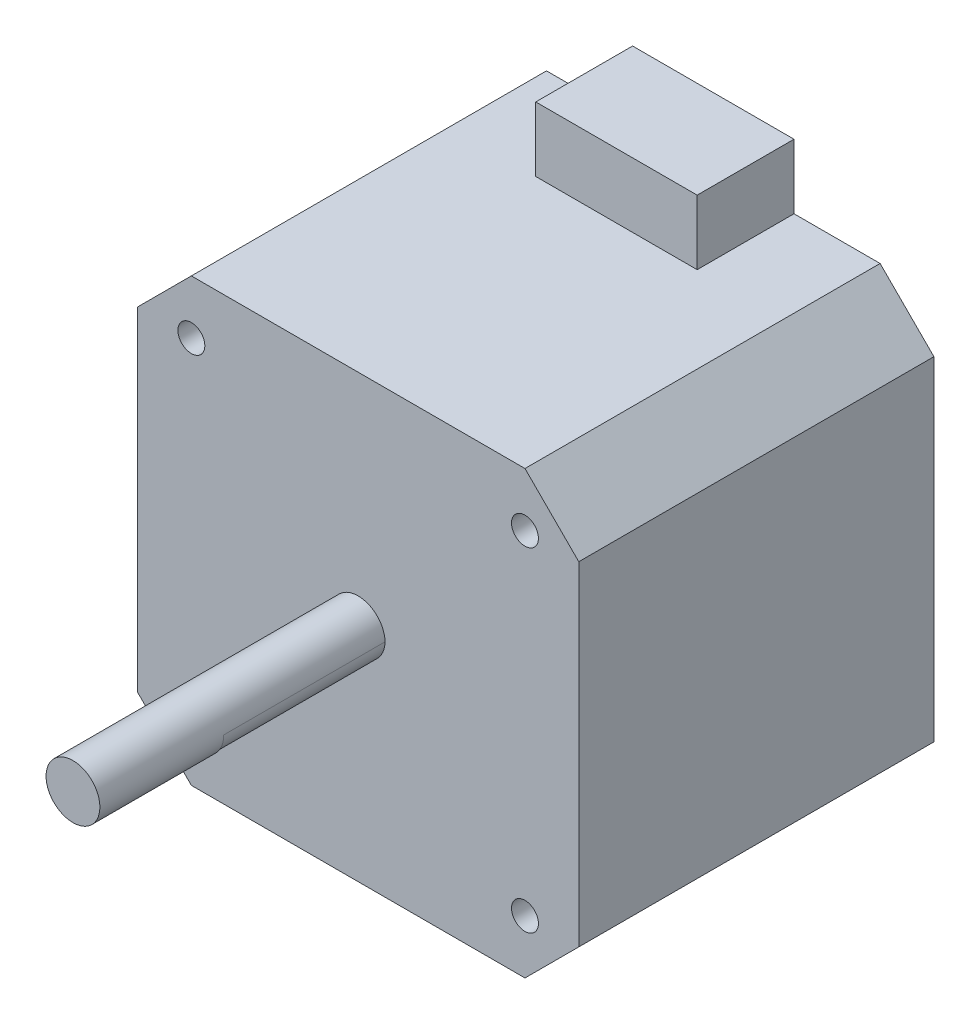
ISO-10303-21;
HEADER;
FILE_DESCRIPTION(('STEP AP214'),'2;1');
FILE_NAME('part.step','',(''),(''),'','','');
FILE_SCHEMA(('AUTOMOTIVE_DESIGN { 1 0 10303 214 1 1 1 1 }'));
ENDSEC;
DATA;
#1=APPLICATION_CONTEXT('core data for automotive mechanical design processes');
#2=APPLICATION_PROTOCOL_DEFINITION('international standard','automotive_design',2000,#1);
#3=PRODUCT_CONTEXT('',#1,'mechanical');
#4=PRODUCT('Part','Part','',(#3));
#5=PRODUCT_RELATED_PRODUCT_CATEGORY('part','',(#4));
#6=PRODUCT_DEFINITION_FORMATION('','',#4);
#7=PRODUCT_DEFINITION_CONTEXT('part definition',#1,'design');
#8=PRODUCT_DEFINITION('design','',#6,#7);
#9=PRODUCT_DEFINITION_SHAPE('','',#8);
#10=(LENGTH_UNIT() NAMED_UNIT(*) SI_UNIT(.MILLI.,.METRE.));
#11=(NAMED_UNIT(*) PLANE_ANGLE_UNIT() SI_UNIT($,.RADIAN.));
#12=(NAMED_UNIT(*) SI_UNIT($,.STERADIAN.) SOLID_ANGLE_UNIT());
#13=UNCERTAINTY_MEASURE_WITH_UNIT(LENGTH_MEASURE(1.E-05),#10,'distance_accuracy_value','');
#14=(GEOMETRIC_REPRESENTATION_CONTEXT(3) GLOBAL_UNCERTAINTY_ASSIGNED_CONTEXT((#13)) GLOBAL_UNIT_ASSIGNED_CONTEXT((#10,
#11,#12)) REPRESENTATION_CONTEXT('',''));
#15=CARTESIAN_POINT('',(0.,0.,0.));
#16=DIRECTION('',(0.,0.,1.));
#17=DIRECTION('',(1.,0.,0.));
#18=AXIS2_PLACEMENT_3D('',#15,#16,#17);
#19=CARTESIAN_POINT('',(1.84738139533539,-5.49870017331023,48.));
#20=DIRECTION('',(0.,0.,1.));
#21=DIRECTION('',(1.,0.,0.));
#22=AXIS2_PLACEMENT_3D('',#19,#20,#21);
#23=PLANE('',#22);
#24=CARTESIAN_POINT('',(1.84738139533538,-8.3884697921986,48.));
#25=DIRECTION('',(0.,0.,1.));
#26=DIRECTION('',(1.,0.,0.));
#27=AXIS2_PLACEMENT_3D('',#24,#25,#26);
#28=CIRCLE('',#27,2.5);
#29=CARTESIAN_POINT('',(-0.652010993980461,-8.44358498275465,48.));
#30=VERTEX_POINT('',#29);
#31=CARTESIAN_POINT('',(4.34677378465124,-8.44358498275418,48.));
#32=VERTEX_POINT('',#31);
#33=EDGE_CURVE('E182',#30,#32,#28,.T.);
#34=ORIENTED_EDGE('',*,*,#33,.T.);
#35=CARTESIAN_POINT('',(1.8473813953354,-8.49870017331023,48.));
#36=DIRECTION('',(0.,0.,1.));
#37=DIRECTION('',(1.,0.,0.));
#38=AXIS2_PLACEMENT_3D('',#35,#36,#37);
#39=CIRCLE('',#38,2.5);
#40=EDGE_CURVE('E71',#32,#30,#39,.F.);
#41=ORIENTED_EDGE('',*,*,#40,.T.);
#42=EDGE_LOOP('',(#34,#41));
#43=FACE_BOUND('',#42,.T.);
#44=ADVANCED_FACE('F56',(#43),#23,.F.);
#45=CARTESIAN_POINT('',(17.3473813953354,12.0012998266898,33.));
#46=DIRECTION('',(-0.707106781186548,-0.707106781186547,0.));
#47=DIRECTION('',(0.,0.,-1.));
#48=AXIS2_PLACEMENT_3D('',#45,#46,#47);
#49=PLANE('',#48);
#50=DIRECTION('',(0.,0.,-1.));
#51=VECTOR('',#50,1.);
#52=CARTESIAN_POINT('',(17.3473813953354,12.0012998266898,33.));
#53=LINE('',#52,#51);
#54=CARTESIAN_POINT('',(17.3473813953354,12.0012998266898,33.));
#55=VERTEX_POINT('',#54);
#56=CARTESIAN_POINT('',(17.3473813953354,12.0012998266898,0.));
#57=VERTEX_POINT('',#56);
#58=EDGE_CURVE('E272',#55,#57,#53,.T.);
#59=ORIENTED_EDGE('',*,*,#58,.F.);
#60=DIRECTION('',(0.707106781186547,-0.707106781186548,0.));
#61=VECTOR('',#60,1.);
#62=CARTESIAN_POINT('',(14.6743406110126,14.6743406110126,33.));
#63=LINE('',#62,#61);
#64=CARTESIAN_POINT('',(22.3473813953354,7.00129982668977,33.));
#65=VERTEX_POINT('',#64);
#66=EDGE_CURVE('E64',#65,#55,#63,.F.);
#67=ORIENTED_EDGE('',*,*,#66,.F.);
#68=DIRECTION('',(0.,0.,1.));
#69=VECTOR('',#68,1.);
#70=CARTESIAN_POINT('',(22.3473813953354,7.00129982668977,33.));
#71=LINE('',#70,#69);
#72=CARTESIAN_POINT('',(22.3473813953354,7.00129982668977,0.));
#73=VERTEX_POINT('',#72);
#74=EDGE_CURVE('E275',#73,#65,#71,.T.);
#75=ORIENTED_EDGE('',*,*,#74,.F.);
#76=DIRECTION('',(-0.707106781186547,0.707106781186548,0.));
#77=VECTOR('',#76,1.);
#78=CARTESIAN_POINT('',(17.3473813953354,12.0012998266898,0.));
#79=LINE('',#78,#77);
#80=EDGE_CURVE('E14',#57,#73,#79,.F.);
#81=ORIENTED_EDGE('',*,*,#80,.F.);
#82=EDGE_LOOP('',(#59,#67,#75,#81));
#83=FACE_BOUND('',#82,.T.);
#84=ADVANCED_FACE('F58',(#83),#49,.F.);
#85=CARTESIAN_POINT('',(17.3473813953354,-28.9987001733102,33.));
#86=DIRECTION('',(-0.707106781186547,0.707106781186547,0.));
#87=DIRECTION('',(0.,0.,1.));
#88=AXIS2_PLACEMENT_3D('',#85,#86,#87);
#89=PLANE('',#88);
#90=DIRECTION('',(0.,0.,1.));
#91=VECTOR('',#90,1.);
#92=CARTESIAN_POINT('',(17.3473813953354,-28.9987001733102,33.));
#93=LINE('',#92,#91);
#94=CARTESIAN_POINT('',(17.3473813953354,-28.9987001733102,0.));
#95=VERTEX_POINT('',#94);
#96=CARTESIAN_POINT('',(17.3473813953354,-28.9987001733102,33.));
#97=VERTEX_POINT('',#96);
#98=EDGE_CURVE('E262',#95,#97,#93,.T.);
#99=ORIENTED_EDGE('',*,*,#98,.F.);
#100=DIRECTION('',(0.707106781186548,0.707106781186548,0.));
#101=VECTOR('',#100,1.);
#102=CARTESIAN_POINT('',(17.3473813953354,-28.9987001733102,0.));
#103=LINE('',#102,#101);
#104=CARTESIAN_POINT('',(22.3473813953354,-23.9987001733102,0.));
#105=VERTEX_POINT('',#104);
#106=EDGE_CURVE('E268',#105,#95,#103,.F.);
#107=ORIENTED_EDGE('',*,*,#106,.F.);
#108=DIRECTION('',(0.,0.,-1.));
#109=VECTOR('',#108,1.);
#110=CARTESIAN_POINT('',(22.3473813953354,-23.9987001733102,33.));
#111=LINE('',#110,#109);
#112=CARTESIAN_POINT('',(22.3473813953354,-23.9987001733102,33.));
#113=VERTEX_POINT('',#112);
#114=EDGE_CURVE('E265',#113,#105,#111,.T.);
#115=ORIENTED_EDGE('',*,*,#114,.F.);
#116=DIRECTION('',(-0.707106781186548,-0.707106781186548,0.));
#117=VECTOR('',#116,1.);
#118=CARTESIAN_POINT('',(23.1730407843228,-23.1730407843228,33.));
#119=LINE('',#118,#117);
#120=EDGE_CURVE('E270',#97,#113,#119,.F.);
#121=ORIENTED_EDGE('',*,*,#120,.F.);
#122=EDGE_LOOP('',(#99,#107,#115,#121));
#123=FACE_BOUND('',#122,.T.);
#124=ADVANCED_FACE('F305',(#123),#89,.F.);
#125=CARTESIAN_POINT('',(-13.6526186046646,-28.9987001733102,33.));
#126=DIRECTION('',(0.707106781186547,0.707106781186548,0.));
#127=DIRECTION('',(0.,0.,-1.));
#128=AXIS2_PLACEMENT_3D('',#125,#126,#127);
#129=PLANE('',#128);
#130=DIRECTION('',(0.,0.,-1.));
#131=VECTOR('',#130,1.);
#132=CARTESIAN_POINT('',(-13.6526186046646,-28.9987001733102,33.));
#133=LINE('',#132,#131);
#134=CARTESIAN_POINT('',(-13.6526186046646,-28.9987001733102,33.));
#135=VERTEX_POINT('',#134);
#136=CARTESIAN_POINT('',(-13.6526186046646,-28.9987001733102,0.));
#137=VERTEX_POINT('',#136);
#138=EDGE_CURVE('E252',#135,#137,#133,.T.);
#139=ORIENTED_EDGE('',*,*,#138,.F.);
#140=DIRECTION('',(-0.707106781186548,0.707106781186547,0.));
#141=VECTOR('',#140,1.);
#142=CARTESIAN_POINT('',(-21.3256593889874,-21.3256593889874,33.));
#143=LINE('',#142,#141);
#144=CARTESIAN_POINT('',(-18.6526186046646,-23.9987001733102,33.));
#145=VERTEX_POINT('',#144);
#146=EDGE_CURVE('E258',#145,#135,#143,.F.);
#147=ORIENTED_EDGE('',*,*,#146,.F.);
#148=DIRECTION('',(0.,0.,1.));
#149=VECTOR('',#148,1.);
#150=CARTESIAN_POINT('',(-18.6526186046646,-23.9987001733102,33.));
#151=LINE('',#150,#149);
#152=CARTESIAN_POINT('',(-18.6526186046646,-23.9987001733102,0.));
#153=VERTEX_POINT('',#152);
#154=EDGE_CURVE('E255',#153,#145,#151,.T.);
#155=ORIENTED_EDGE('',*,*,#154,.F.);
#156=DIRECTION('',(0.707106781186548,-0.707106781186547,0.));
#157=VECTOR('',#156,1.);
#158=CARTESIAN_POINT('',(-13.6526186046646,-28.9987001733102,0.));
#159=LINE('',#158,#157);
#160=EDGE_CURVE('E260',#137,#153,#159,.F.);
#161=ORIENTED_EDGE('',*,*,#160,.F.);
#162=EDGE_LOOP('',(#139,#147,#155,#161));
#163=FACE_BOUND('',#162,.T.);
#164=ADVANCED_FACE('F297',(#163),#129,.F.);
#165=CARTESIAN_POINT('',(-13.6526186046646,12.0012998266898,33.));
#166=DIRECTION('',(0.707106781186547,-0.707106781186548,0.));
#167=DIRECTION('',(0.,0.,1.));
#168=AXIS2_PLACEMENT_3D('',#165,#166,#167);
#169=PLANE('',#168);
#170=DIRECTION('',(0.,0.,1.));
#171=VECTOR('',#170,1.);
#172=CARTESIAN_POINT('',(-13.6526186046646,12.0012998266898,33.));
#173=LINE('',#172,#171);
#174=CARTESIAN_POINT('',(-13.6526186046646,12.0012998266898,0.));
#175=VERTEX_POINT('',#174);
#176=CARTESIAN_POINT('',(-13.6526186046646,12.0012998266898,33.));
#177=VERTEX_POINT('',#176);
#178=EDGE_CURVE('E242',#175,#177,#173,.T.);
#179=ORIENTED_EDGE('',*,*,#178,.F.);
#180=DIRECTION('',(-0.707106781186548,-0.707106781186547,0.));
#181=VECTOR('',#180,1.);
#182=CARTESIAN_POINT('',(-13.6526186046646,12.0012998266898,0.));
#183=LINE('',#182,#181);
#184=CARTESIAN_POINT('',(-18.6526186046646,7.00129982668977,0.));
#185=VERTEX_POINT('',#184);
#186=EDGE_CURVE('E248',#185,#175,#183,.F.);
#187=ORIENTED_EDGE('',*,*,#186,.F.);
#188=DIRECTION('',(0.,0.,-1.));
#189=VECTOR('',#188,1.);
#190=CARTESIAN_POINT('',(-18.6526186046646,7.00129982668977,33.));
#191=LINE('',#190,#189);
#192=CARTESIAN_POINT('',(-18.6526186046646,7.00129982668977,33.));
#193=VERTEX_POINT('',#192);
#194=EDGE_CURVE('E245',#193,#185,#191,.T.);
#195=ORIENTED_EDGE('',*,*,#194,.F.);
#196=DIRECTION('',(0.707106781186548,0.707106781186547,0.));
#197=VECTOR('',#196,1.);
#198=CARTESIAN_POINT('',(-12.8269592156772,12.8269592156772,33.));
#199=LINE('',#198,#197);
#200=EDGE_CURVE('E250',#177,#193,#199,.F.);
#201=ORIENTED_EDGE('',*,*,#200,.F.);
#202=EDGE_LOOP('',(#179,#187,#195,#201));
#203=FACE_BOUND('',#202,.T.);
#204=ADVANCED_FACE('F288',(#203),#169,.F.);
#205=CARTESIAN_POINT('',(1.84738139533538,-8.3884697921986,48.));
#206=DIRECTION('',(0.,0.,-1.));
#207=DIRECTION('',(-1.,0.,0.));
#208=AXIS2_PLACEMENT_3D('',#205,#206,#207);
#209=CYLINDRICAL_SURFACE('',#208,2.5);
#210=ORIENTED_EDGE('',*,*,#33,.F.);
#211=DIRECTION('',(0.,0.,-1.));
#212=VECTOR('',#211,1.);
#213=CARTESIAN_POINT('',(-0.652010993980461,-8.44358498275465,52.5));
#214=LINE('',#213,#212);
#215=CARTESIAN_POINT('',(-0.652010993980461,-8.44358498275465,33.));
#216=VERTEX_POINT('',#215);
#217=EDGE_CURVE('E181',#30,#216,#214,.T.);
#218=ORIENTED_EDGE('',*,*,#217,.T.);
#219=CARTESIAN_POINT('',(1.84738139533538,-8.3884697921986,33.));
#220=DIRECTION('',(0.,0.,1.));
#221=DIRECTION('',(1.,0.,0.));
#222=AXIS2_PLACEMENT_3D('',#219,#220,#221);
#223=CIRCLE('',#222,2.5);
#224=CARTESIAN_POINT('',(4.34677378465124,-8.44358498275418,33.));
#225=VERTEX_POINT('',#224);
#226=EDGE_CURVE('E178',#216,#225,#223,.T.);
#227=ORIENTED_EDGE('',*,*,#226,.T.);
#228=DIRECTION('',(0.,0.,-1.));
#229=VECTOR('',#228,1.);
#230=CARTESIAN_POINT('',(4.34677378465124,-8.44358498275418,52.5));
#231=LINE('',#230,#229);
#232=EDGE_CURVE('E165',#225,#32,#231,.F.);
#233=ORIENTED_EDGE('',*,*,#232,.T.);
#234=EDGE_LOOP('',(#210,#218,#227,#233));
#235=FACE_BOUND('',#234,.T.);
#236=ADVANCED_FACE('F180',(#235),#209,.T.);
#237=CARTESIAN_POINT('',(-5.65261860466461,18.0012998266898,33.));
#238=DIRECTION('',(0.,-1.,0.));
#239=DIRECTION('',(0.,0.,-1.));
#240=AXIS2_PLACEMENT_3D('',#237,#238,#239);
#241=PLANE('',#240);
#242=DIRECTION('',(-1.,0.,0.));
#243=VECTOR('',#242,1.);
#244=CARTESIAN_POINT('',(-5.65261860466461,18.0012998266898,9.));
#245=LINE('',#244,#243);
#246=CARTESIAN_POINT('',(9.34738139533539,18.0012998266898,9.));
#247=VERTEX_POINT('',#246);
#248=CARTESIAN_POINT('',(-5.65261860466461,18.0012998266898,9.));
#249=VERTEX_POINT('',#248);
#250=EDGE_CURVE('E197',#247,#249,#245,.T.);
#251=ORIENTED_EDGE('',*,*,#250,.F.);
#252=DIRECTION('',(0.,0.,-1.));
#253=VECTOR('',#252,1.);
#254=CARTESIAN_POINT('',(9.34738139533539,18.0012998266898,33.));
#255=LINE('',#254,#253);
#256=CARTESIAN_POINT('',(9.34738139533539,18.0012998266898,0.));
#257=VERTEX_POINT('',#256);
#258=EDGE_CURVE('E237',#247,#257,#255,.T.);
#259=ORIENTED_EDGE('',*,*,#258,.T.);
#260=DIRECTION('',(-1.,0.,0.));
#261=VECTOR('',#260,1.);
#262=CARTESIAN_POINT('',(-5.65261860466461,18.0012998266898,0.));
#263=LINE('',#262,#261);
#264=CARTESIAN_POINT('',(-5.65261860466461,18.0012998266898,0.));
#265=VERTEX_POINT('',#264);
#266=EDGE_CURVE('E226',#257,#265,#263,.T.);
#267=ORIENTED_EDGE('',*,*,#266,.T.);
#268=DIRECTION('',(0.,0.,-1.));
#269=VECTOR('',#268,1.);
#270=CARTESIAN_POINT('',(-5.65261860466461,18.0012998266898,33.));
#271=LINE('',#270,#269);
#272=EDGE_CURVE('E235',#249,#265,#271,.T.);
#273=ORIENTED_EDGE('',*,*,#272,.F.);
#274=EDGE_LOOP('',(#251,#259,#267,#273));
#275=FACE_BOUND('',#274,.T.);
#276=ADVANCED_FACE('F319',(#275),#241,.F.);
#277=CARTESIAN_POINT('',(-5.65261860466461,12.0012998266898,33.));
#278=DIRECTION('',(1.,0.,0.));
#279=DIRECTION('',(0.,0.,-1.));
#280=AXIS2_PLACEMENT_3D('',#277,#278,#279);
#281=PLANE('',#280);
#282=DIRECTION('',(0.,-1.,0.));
#283=VECTOR('',#282,1.);
#284=CARTESIAN_POINT('',(-5.65261860466461,18.0012998266898,9.));
#285=LINE('',#284,#283);
#286=CARTESIAN_POINT('',(-5.65261860466461,12.0012998266898,9.));
#287=VERTEX_POINT('',#286);
#288=EDGE_CURVE('E185',#249,#287,#285,.T.);
#289=ORIENTED_EDGE('',*,*,#288,.F.);
#290=ORIENTED_EDGE('',*,*,#272,.T.);
#291=DIRECTION('',(0.,-1.,0.));
#292=VECTOR('',#291,1.);
#293=CARTESIAN_POINT('',(-5.65261860466461,12.0012998266898,0.));
#294=LINE('',#293,#292);
#295=CARTESIAN_POINT('',(-5.65261860466461,12.0012998266898,0.));
#296=VERTEX_POINT('',#295);
#297=EDGE_CURVE('E229',#265,#296,#294,.T.);
#298=ORIENTED_EDGE('',*,*,#297,.T.);
#299=DIRECTION('',(0.,0.,-1.));
#300=VECTOR('',#299,1.);
#301=CARTESIAN_POINT('',(-5.65261860466461,12.0012998266898,33.));
#302=LINE('',#301,#300);
#303=EDGE_CURVE('E212',#287,#296,#302,.T.);
#304=ORIENTED_EDGE('',*,*,#303,.F.);
#305=EDGE_LOOP('',(#289,#290,#298,#304));
#306=FACE_BOUND('',#305,.T.);
#307=ADVANCED_FACE('F315',(#306),#281,.F.);
#308=CARTESIAN_POINT('',(0.,0.,9.));
#309=DIRECTION('',(0.,0.,1.));
#310=DIRECTION('',(1.,0.,0.));
#311=AXIS2_PLACEMENT_3D('',#308,#309,#310);
#312=PLANE('',#311);
#313=ORIENTED_EDGE('',*,*,#288,.T.);
#314=DIRECTION('',(1.,0.,0.));
#315=VECTOR('',#314,1.);
#316=CARTESIAN_POINT('',(-5.65261860466461,12.0012998266898,9.));
#317=LINE('',#316,#315);
#318=CARTESIAN_POINT('',(9.34738139533539,12.0012998266898,9.));
#319=VERTEX_POINT('',#318);
#320=EDGE_CURVE('E193',#287,#319,#317,.T.);
#321=ORIENTED_EDGE('',*,*,#320,.T.);
#322=DIRECTION('',(0.,1.,0.));
#323=VECTOR('',#322,1.);
#324=CARTESIAN_POINT('',(9.34738139533539,18.0012998266898,9.));
#325=LINE('',#324,#323);
#326=EDGE_CURVE('E195',#319,#247,#325,.T.);
#327=ORIENTED_EDGE('',*,*,#326,.T.);
#328=ORIENTED_EDGE('',*,*,#250,.T.);
#329=EDGE_LOOP('',(#313,#321,#327,#328));
#330=FACE_BOUND('',#329,.T.);
#331=ADVANCED_FACE('F326',(#330),#312,.T.);
#332=CARTESIAN_POINT('',(9.34738139533539,12.0012998266898,33.));
#333=DIRECTION('',(-1.,0.,0.));
#334=DIRECTION('',(0.,0.,1.));
#335=AXIS2_PLACEMENT_3D('',#332,#333,#334);
#336=PLANE('',#335);
#337=ORIENTED_EDGE('',*,*,#326,.F.);
#338=DIRECTION('',(0.,0.,-1.));
#339=VECTOR('',#338,1.);
#340=CARTESIAN_POINT('',(9.34738139533539,12.0012998266898,33.));
#341=LINE('',#340,#339);
#342=CARTESIAN_POINT('',(9.34738139533539,12.0012998266898,0.));
#343=VERTEX_POINT('',#342);
#344=EDGE_CURVE('E239',#319,#343,#341,.T.);
#345=ORIENTED_EDGE('',*,*,#344,.T.);
#346=DIRECTION('',(0.,1.,0.));
#347=VECTOR('',#346,1.);
#348=CARTESIAN_POINT('',(9.34738139533539,12.0012998266898,0.));
#349=LINE('',#348,#347);
#350=EDGE_CURVE('E223',#343,#257,#349,.T.);
#351=ORIENTED_EDGE('',*,*,#350,.T.);
#352=ORIENTED_EDGE('',*,*,#258,.F.);
#353=EDGE_LOOP('',(#337,#345,#351,#352));
#354=FACE_BOUND('',#353,.T.);
#355=ADVANCED_FACE('F323',(#354),#336,.F.);
#356=CARTESIAN_POINT('',(0.,0.,0.));
#357=DIRECTION('',(0.,0.,1.));
#358=DIRECTION('',(1.,0.,0.));
#359=AXIS2_PLACEMENT_3D('',#356,#357,#358);
#360=PLANE('',#359);
#361=DIRECTION('',(-1.,0.,0.));
#362=VECTOR('',#361,1.);
#363=CARTESIAN_POINT('',(9.34738139533539,12.0012998266898,0.));
#364=LINE('',#363,#362);
#365=EDGE_CURVE('E221',#57,#343,#364,.T.);
#366=ORIENTED_EDGE('',*,*,#365,.F.);
#367=ORIENTED_EDGE('',*,*,#80,.T.);
#368=DIRECTION('',(0.,1.,0.));
#369=VECTOR('',#368,1.);
#370=CARTESIAN_POINT('',(22.3473813953354,12.0012998266898,0.));
#371=LINE('',#370,#369);
#372=EDGE_CURVE('E218',#105,#73,#371,.T.);
#373=ORIENTED_EDGE('',*,*,#372,.F.);
#374=ORIENTED_EDGE('',*,*,#106,.T.);
#375=DIRECTION('',(1.,0.,0.));
#376=VECTOR('',#375,1.);
#377=CARTESIAN_POINT('',(-18.6526186046646,-28.9987001733102,0.));
#378=LINE('',#377,#376);
#379=EDGE_CURVE('E215',#137,#95,#378,.T.);
#380=ORIENTED_EDGE('',*,*,#379,.F.);
#381=ORIENTED_EDGE('',*,*,#160,.T.);
#382=DIRECTION('',(0.,-1.,0.));
#383=VECTOR('',#382,1.);
#384=CARTESIAN_POINT('',(-18.6526186046646,12.0012998266898,0.));
#385=LINE('',#384,#383);
#386=EDGE_CURVE('E199',#185,#153,#385,.T.);
#387=ORIENTED_EDGE('',*,*,#386,.F.);
#388=ORIENTED_EDGE('',*,*,#186,.T.);
#389=DIRECTION('',(-1.,0.,0.));
#390=VECTOR('',#389,1.);
#391=CARTESIAN_POINT('',(-18.6526186046646,12.0012998266898,0.));
#392=LINE('',#391,#390);
#393=EDGE_CURVE('E204',#296,#175,#392,.T.);
#394=ORIENTED_EDGE('',*,*,#393,.F.);
#395=ORIENTED_EDGE('',*,*,#297,.F.);
#396=ORIENTED_EDGE('',*,*,#266,.F.);
#397=ORIENTED_EDGE('',*,*,#350,.F.);
#398=EDGE_LOOP('',(#366,#367,#373,#374,#380,#381,#387,#388,#394,#395,#396,#397));
#399=FACE_BOUND('',#398,.T.);
#400=ADVANCED_FACE('F308',(#399),#360,.F.);
#401=CARTESIAN_POINT('',(22.3473813953354,12.0012998266898,33.));
#402=DIRECTION('',(-1.,0.,0.));
#403=DIRECTION('',(0.,-1.,0.));
#404=AXIS2_PLACEMENT_3D('',#401,#402,#403);
#405=PLANE('',#404);
#406=ORIENTED_EDGE('',*,*,#372,.T.);
#407=ORIENTED_EDGE('',*,*,#74,.T.);
#408=DIRECTION('',(0.,1.,0.));
#409=VECTOR('',#408,1.);
#410=CARTESIAN_POINT('',(22.3473813953354,12.0012998266898,33.));
#411=LINE('',#410,#409);
#412=EDGE_CURVE('E207',#113,#65,#411,.T.);
#413=ORIENTED_EDGE('',*,*,#412,.F.);
#414=ORIENTED_EDGE('',*,*,#114,.T.);
#415=EDGE_LOOP('',(#406,#407,#413,#414));
#416=FACE_BOUND('',#415,.T.);
#417=ADVANCED_FACE('F307',(#416),#405,.F.);
#418=CARTESIAN_POINT('',(-18.6526186046646,-28.9987001733102,33.));
#419=DIRECTION('',(0.,1.,0.));
#420=DIRECTION('',(0.,0.,1.));
#421=AXIS2_PLACEMENT_3D('',#418,#419,#420);
#422=PLANE('',#421);
#423=ORIENTED_EDGE('',*,*,#379,.T.);
#424=ORIENTED_EDGE('',*,*,#98,.T.);
#425=DIRECTION('',(1.,0.,0.));
#426=VECTOR('',#425,1.);
#427=CARTESIAN_POINT('',(-18.6526186046646,-28.9987001733102,33.));
#428=LINE('',#427,#426);
#429=EDGE_CURVE('E203',#135,#97,#428,.T.);
#430=ORIENTED_EDGE('',*,*,#429,.F.);
#431=ORIENTED_EDGE('',*,*,#138,.T.);
#432=EDGE_LOOP('',(#423,#424,#430,#431));
#433=FACE_BOUND('',#432,.T.);
#434=ADVANCED_FACE('F301',(#433),#422,.F.);
#435=CARTESIAN_POINT('',(-18.6526186046646,12.0012998266898,33.));
#436=DIRECTION('',(1.,0.,0.));
#437=DIRECTION('',(0.,1.,0.));
#438=AXIS2_PLACEMENT_3D('',#435,#436,#437);
#439=PLANE('',#438);
#440=ORIENTED_EDGE('',*,*,#386,.T.);
#441=ORIENTED_EDGE('',*,*,#154,.T.);
#442=DIRECTION('',(0.,-1.,0.));
#443=VECTOR('',#442,1.);
#444=CARTESIAN_POINT('',(-18.6526186046646,12.0012998266898,33.));
#445=LINE('',#444,#443);
#446=EDGE_CURVE('E200',#193,#145,#445,.T.);
#447=ORIENTED_EDGE('',*,*,#446,.F.);
#448=ORIENTED_EDGE('',*,*,#194,.T.);
#449=EDGE_LOOP('',(#440,#441,#447,#448));
#450=FACE_BOUND('',#449,.T.);
#451=ADVANCED_FACE('F293',(#450),#439,.F.);
#452=CARTESIAN_POINT('',(-18.6526186046646,12.0012998266898,33.));
#453=DIRECTION('',(0.,-1.,0.));
#454=DIRECTION('',(0.,0.,-1.));
#455=AXIS2_PLACEMENT_3D('',#452,#453,#454);
#456=PLANE('',#455);
#457=DIRECTION('',(-1.,0.,0.));
#458=VECTOR('',#457,1.);
#459=CARTESIAN_POINT('',(9.34738139533539,12.0012998266898,33.));
#460=LINE('',#459,#458);
#461=EDGE_CURVE('E210',#55,#177,#460,.T.);
#462=ORIENTED_EDGE('',*,*,#461,.F.);
#463=ORIENTED_EDGE('',*,*,#58,.T.);
#464=ORIENTED_EDGE('',*,*,#365,.T.);
#465=ORIENTED_EDGE('',*,*,#344,.F.);
#466=ORIENTED_EDGE('',*,*,#320,.F.);
#467=ORIENTED_EDGE('',*,*,#303,.T.);
#468=ORIENTED_EDGE('',*,*,#393,.T.);
#469=ORIENTED_EDGE('',*,*,#178,.T.);
#470=EDGE_LOOP('',(#462,#463,#464,#465,#466,#467,#468,#469));
#471=FACE_BOUND('',#470,.T.);
#472=ADVANCED_FACE('F284',(#471),#456,.F.);
#473=CARTESIAN_POINT('',(0.,0.,33.));
#474=DIRECTION('',(0.,0.,1.));
#475=DIRECTION('',(1.,0.,0.));
#476=AXIS2_PLACEMENT_3D('',#473,#474,#475);
#477=PLANE('',#476);
#478=CARTESIAN_POINT('',(17.3473813953354,7.00129982668977,33.));
#479=DIRECTION('',(0.,0.,1.));
#480=DIRECTION('',(1.,0.,0.));
#481=AXIS2_PLACEMENT_3D('',#478,#479,#480);
#482=CIRCLE('',#481,1.24999999999999);
#483=CARTESIAN_POINT('',(18.5973813953354,7.00129982668977,33.));
#484=VERTEX_POINT('',#483);
#485=EDGE_CURVE('E387',#484,#484,#482,.T.);
#486=ORIENTED_EDGE('',*,*,#485,.F.);
#487=EDGE_LOOP('',(#486));
#488=FACE_BOUND('',#487,.T.);
#489=CARTESIAN_POINT('',(17.3473813953357,-23.9987001733102,33.));
#490=DIRECTION('',(0.,0.,1.));
#491=DIRECTION('',(1.,0.,0.));
#492=AXIS2_PLACEMENT_3D('',#489,#490,#491);
#493=CIRCLE('',#492,1.24999999999999);
#494=CARTESIAN_POINT('',(18.5973813953357,-23.9987001733102,33.));
#495=VERTEX_POINT('',#494);
#496=EDGE_CURVE('E397',#495,#495,#493,.T.);
#497=ORIENTED_EDGE('',*,*,#496,.F.);
#498=EDGE_LOOP('',(#497));
#499=FACE_BOUND('',#498,.T.);
#500=CARTESIAN_POINT('',(-13.6526186046643,-23.9987001733104,33.));
#501=DIRECTION('',(0.,0.,1.));
#502=DIRECTION('',(1.,0.,0.));
#503=AXIS2_PLACEMENT_3D('',#500,#501,#502);
#504=CIRCLE('',#503,1.24999999999999);
#505=CARTESIAN_POINT('',(-12.4026186046643,-23.9987001733104,33.));
#506=VERTEX_POINT('',#505);
#507=EDGE_CURVE('E403',#506,#506,#504,.T.);
#508=ORIENTED_EDGE('',*,*,#507,.F.);
#509=EDGE_LOOP('',(#508));
#510=FACE_BOUND('',#509,.T.);
#511=CARTESIAN_POINT('',(-13.6526186046646,7.00129982668956,33.));
#512=DIRECTION('',(0.,0.,1.));
#513=DIRECTION('',(1.,0.,0.));
#514=AXIS2_PLACEMENT_3D('',#511,#512,#513);
#515=CIRCLE('',#514,1.24999999999999);
#516=CARTESIAN_POINT('',(-12.4026186046646,7.00129982668956,33.));
#517=VERTEX_POINT('',#516);
#518=EDGE_CURVE('E188',#517,#517,#515,.T.);
#519=ORIENTED_EDGE('',*,*,#518,.F.);
#520=EDGE_LOOP('',(#519));
#521=FACE_BOUND('',#520,.T.);
#522=ORIENTED_EDGE('',*,*,#412,.T.);
#523=ORIENTED_EDGE('',*,*,#66,.T.);
#524=ORIENTED_EDGE('',*,*,#461,.T.);
#525=ORIENTED_EDGE('',*,*,#200,.T.);
#526=ORIENTED_EDGE('',*,*,#446,.T.);
#527=ORIENTED_EDGE('',*,*,#146,.T.);
#528=ORIENTED_EDGE('',*,*,#429,.T.);
#529=ORIENTED_EDGE('',*,*,#120,.T.);
#530=EDGE_LOOP('',(#522,#523,#524,#525,#526,#527,#528,#529));
#531=FACE_BOUND('',#530,.T.);
#532=ORIENTED_EDGE('',*,*,#226,.F.);
#533=CARTESIAN_POINT('',(1.8473813953354,-8.49870017331023,33.));
#534=DIRECTION('',(0.,0.,1.));
#535=DIRECTION('',(1.,0.,0.));
#536=AXIS2_PLACEMENT_3D('',#533,#534,#535);
#537=CIRCLE('',#536,2.5);
#538=EDGE_CURVE('E168',#225,#216,#537,.T.);
#539=ORIENTED_EDGE('',*,*,#538,.F.);
#540=EDGE_LOOP('',(#532,#539));
#541=FACE_BOUND('',#540,.T.);
#542=ADVANCED_FACE('F177',(#488,#499,#510,#521,#531,#541),#477,.T.);
#543=CARTESIAN_POINT('',(-13.6526186046646,7.00129982668956,25.));
#544=DIRECTION('',(0.,0.,1.));
#545=DIRECTION('',(1.,0.,0.));
#546=AXIS2_PLACEMENT_3D('',#543,#544,#545);
#547=CONICAL_SURFACE('',#546,1.24999999999999,1.02974425867665);
#548=CARTESIAN_POINT('',(-13.6526186046646,7.00129982668956,24.2489242262155));
#549=VERTEX_POINT('',#548);
#550=VERTEX_LOOP('',#549);
#551=FACE_BOUND('',#550,.T.);
#552=CARTESIAN_POINT('',(-13.6526186046646,7.00129982668956,25.));
#553=DIRECTION('',(0.,0.,1.));
#554=DIRECTION('',(1.,0.,0.));
#555=AXIS2_PLACEMENT_3D('',#552,#553,#554);
#556=CIRCLE('',#555,1.24999999999999);
#557=CARTESIAN_POINT('',(-12.4026186046646,7.00129982668956,25.));
#558=VERTEX_POINT('',#557);
#559=EDGE_CURVE('E183',#558,#558,#556,.T.);
#560=ORIENTED_EDGE('',*,*,#559,.T.);
#561=EDGE_LOOP('',(#560));
#562=FACE_BOUND('',#561,.T.);
#563=ADVANCED_FACE('F345',(#551,#562),#547,.F.);
#564=CARTESIAN_POINT('',(-13.6526186046646,7.00129982668956,33.));
#565=DIRECTION('',(0.,0.,1.));
#566=DIRECTION('',(1.,0.,0.));
#567=AXIS2_PLACEMENT_3D('',#564,#565,#566);
#568=CYLINDRICAL_SURFACE('',#567,1.24999999999999);
#569=ORIENTED_EDGE('',*,*,#559,.F.);
#570=EDGE_LOOP('',(#569));
#571=FACE_BOUND('',#570,.T.);
#572=ORIENTED_EDGE('',*,*,#518,.T.);
#573=EDGE_LOOP('',(#572));
#574=FACE_BOUND('',#573,.T.);
#575=ADVANCED_FACE('F348',(#571,#574),#568,.F.);
#576=CARTESIAN_POINT('',(-13.6526186046643,-23.9987001733104,25.));
#577=DIRECTION('',(0.,0.,1.));
#578=DIRECTION('',(1.,0.,0.));
#579=AXIS2_PLACEMENT_3D('',#576,#577,#578);
#580=CONICAL_SURFACE('',#579,1.24999999999999,1.02974425867665);
#581=CARTESIAN_POINT('',(-13.6526186046643,-23.9987001733104,24.2489242262155));
#582=VERTEX_POINT('',#581);
#583=VERTEX_LOOP('',#582);
#584=FACE_BOUND('',#583,.T.);
#585=CARTESIAN_POINT('',(-13.6526186046643,-23.9987001733104,25.));
#586=DIRECTION('',(0.,0.,1.));
#587=DIRECTION('',(1.,0.,0.));
#588=AXIS2_PLACEMENT_3D('',#585,#586,#587);
#589=CIRCLE('',#588,1.24999999999999);
#590=CARTESIAN_POINT('',(-12.4026186046643,-23.9987001733104,25.));
#591=VERTEX_POINT('',#590);
#592=EDGE_CURVE('E406',#591,#591,#589,.T.);
#593=ORIENTED_EDGE('',*,*,#592,.T.);
#594=EDGE_LOOP('',(#593));
#595=FACE_BOUND('',#594,.T.);
#596=ADVANCED_FACE('F352',(#584,#595),#580,.F.);
#597=CARTESIAN_POINT('',(-13.6526186046643,-23.9987001733104,33.));
#598=DIRECTION('',(0.,0.,1.));
#599=DIRECTION('',(1.,0.,0.));
#600=AXIS2_PLACEMENT_3D('',#597,#598,#599);
#601=CYLINDRICAL_SURFACE('',#600,1.24999999999999);
#602=ORIENTED_EDGE('',*,*,#592,.F.);
#603=EDGE_LOOP('',(#602));
#604=FACE_BOUND('',#603,.T.);
#605=ORIENTED_EDGE('',*,*,#507,.T.);
#606=EDGE_LOOP('',(#605));
#607=FACE_BOUND('',#606,.T.);
#608=ADVANCED_FACE('F356',(#604,#607),#601,.F.);
#609=CARTESIAN_POINT('',(17.3473813953357,-23.9987001733102,25.));
#610=DIRECTION('',(0.,0.,1.));
#611=DIRECTION('',(1.,0.,0.));
#612=AXIS2_PLACEMENT_3D('',#609,#610,#611);
#613=CONICAL_SURFACE('',#612,1.24999999999999,1.02974425867665);
#614=CARTESIAN_POINT('',(17.3473813953357,-23.9987001733102,24.2489242262155));
#615=VERTEX_POINT('',#614);
#616=VERTEX_LOOP('',#615);
#617=FACE_BOUND('',#616,.T.);
#618=CARTESIAN_POINT('',(17.3473813953357,-23.9987001733102,25.));
#619=DIRECTION('',(0.,0.,1.));
#620=DIRECTION('',(1.,0.,0.));
#621=AXIS2_PLACEMENT_3D('',#618,#619,#620);
#622=CIRCLE('',#621,1.24999999999999);
#623=CARTESIAN_POINT('',(18.5973813953357,-23.9987001733102,25.));
#624=VERTEX_POINT('',#623);
#625=EDGE_CURVE('E400',#624,#624,#622,.T.);
#626=ORIENTED_EDGE('',*,*,#625,.T.);
#627=EDGE_LOOP('',(#626));
#628=FACE_BOUND('',#627,.T.);
#629=ADVANCED_FACE('F360',(#617,#628),#613,.F.);
#630=CARTESIAN_POINT('',(17.3473813953357,-23.9987001733102,33.));
#631=DIRECTION('',(0.,0.,1.));
#632=DIRECTION('',(1.,0.,0.));
#633=AXIS2_PLACEMENT_3D('',#630,#631,#632);
#634=CYLINDRICAL_SURFACE('',#633,1.24999999999999);
#635=ORIENTED_EDGE('',*,*,#625,.F.);
#636=EDGE_LOOP('',(#635));
#637=FACE_BOUND('',#636,.T.);
#638=ORIENTED_EDGE('',*,*,#496,.T.);
#639=EDGE_LOOP('',(#638));
#640=FACE_BOUND('',#639,.T.);
#641=ADVANCED_FACE('F364',(#637,#640),#634,.F.);
#642=CARTESIAN_POINT('',(17.3473813953354,7.00129982668977,25.));
#643=DIRECTION('',(0.,0.,1.));
#644=DIRECTION('',(1.,0.,0.));
#645=AXIS2_PLACEMENT_3D('',#642,#643,#644);
#646=CONICAL_SURFACE('',#645,1.24999999999999,1.02974425867665);
#647=CARTESIAN_POINT('',(17.3473813953354,7.00129982668977,24.2489242262155));
#648=VERTEX_POINT('',#647);
#649=VERTEX_LOOP('',#648);
#650=FACE_BOUND('',#649,.T.);
#651=CARTESIAN_POINT('',(17.3473813953354,7.00129982668977,25.));
#652=DIRECTION('',(0.,0.,1.));
#653=DIRECTION('',(1.,0.,0.));
#654=AXIS2_PLACEMENT_3D('',#651,#652,#653);
#655=CIRCLE('',#654,1.24999999999999);
#656=CARTESIAN_POINT('',(18.5973813953354,7.00129982668977,25.));
#657=VERTEX_POINT('',#656);
#658=EDGE_CURVE('E390',#657,#657,#655,.T.);
#659=ORIENTED_EDGE('',*,*,#658,.T.);
#660=EDGE_LOOP('',(#659));
#661=FACE_BOUND('',#660,.T.);
#662=ADVANCED_FACE('F368',(#650,#661),#646,.F.);
#663=CARTESIAN_POINT('',(17.3473813953354,7.00129982668977,33.));
#664=DIRECTION('',(0.,0.,1.));
#665=DIRECTION('',(1.,0.,0.));
#666=AXIS2_PLACEMENT_3D('',#663,#664,#665);
#667=CYLINDRICAL_SURFACE('',#666,1.24999999999999);
#668=ORIENTED_EDGE('',*,*,#658,.F.);
#669=EDGE_LOOP('',(#668));
#670=FACE_BOUND('',#669,.T.);
#671=ORIENTED_EDGE('',*,*,#485,.T.);
#672=EDGE_LOOP('',(#671));
#673=FACE_BOUND('',#672,.T.);
#674=ADVANCED_FACE('F372',(#670,#673),#667,.F.);
#675=CARTESIAN_POINT('',(1.8473813953354,-8.49870017331023,72.));
#676=DIRECTION('',(0.,0.,-1.));
#677=DIRECTION('',(-1.,0.,0.));
#678=AXIS2_PLACEMENT_3D('',#675,#676,#677);
#679=CYLINDRICAL_SURFACE('',#678,2.5);
#680=CARTESIAN_POINT('',(1.8473813953354,-8.49870017331023,59.5));
#681=DIRECTION('',(0.,0.,1.));
#682=DIRECTION('',(1.,0.,0.));
#683=AXIS2_PLACEMENT_3D('',#680,#681,#682);
#684=CIRCLE('',#683,2.5);
#685=CARTESIAN_POINT('',(4.3473813953354,-8.49870017331023,59.5));
#686=VERTEX_POINT('',#685);
#687=EDGE_CURVE('E386',#686,#686,#684,.F.);
#688=ORIENTED_EDGE('',*,*,#687,.T.);
#689=EDGE_LOOP('',(#688));
#690=FACE_BOUND('',#689,.T.);
#691=ORIENTED_EDGE('',*,*,#40,.F.);
#692=ORIENTED_EDGE('',*,*,#232,.F.);
#693=ORIENTED_EDGE('',*,*,#538,.T.);
#694=ORIENTED_EDGE('',*,*,#217,.F.);
#695=EDGE_LOOP('',(#691,#692,#693,#694));
#696=FACE_BOUND('',#695,.T.);
#697=ADVANCED_FACE('F167',(#690,#696),#679,.T.);
#698=CARTESIAN_POINT('',(1.8473813953354,-8.49870017331023,59.5));
#699=DIRECTION('',(0.,0.,1.));
#700=DIRECTION('',(1.,0.,0.));
#701=AXIS2_PLACEMENT_3D('',#698,#699,#700);
#702=PLANE('',#701);
#703=ORIENTED_EDGE('',*,*,#687,.F.);
#704=EDGE_LOOP('',(#703));
#705=FACE_BOUND('',#704,.T.);
#706=ADVANCED_FACE('F378',(#705),#702,.T.);
#707=CLOSED_SHELL('',(#44,#84,#124,#164,#204,#236,#276,#307,#331,#355,#400,#417,#434,#451,#472,
#542,#563,#575,#596,#608,#629,#641,#662,#674,#697,#706));
#708=MANIFOLD_SOLID_BREP('B2',#707);
#709=ADVANCED_BREP_SHAPE_REPRESENTATION('',(#18,#708),#14);
#710=SHAPE_DEFINITION_REPRESENTATION(#9,#709);
ENDSEC;
END-ISO-10303-21;
